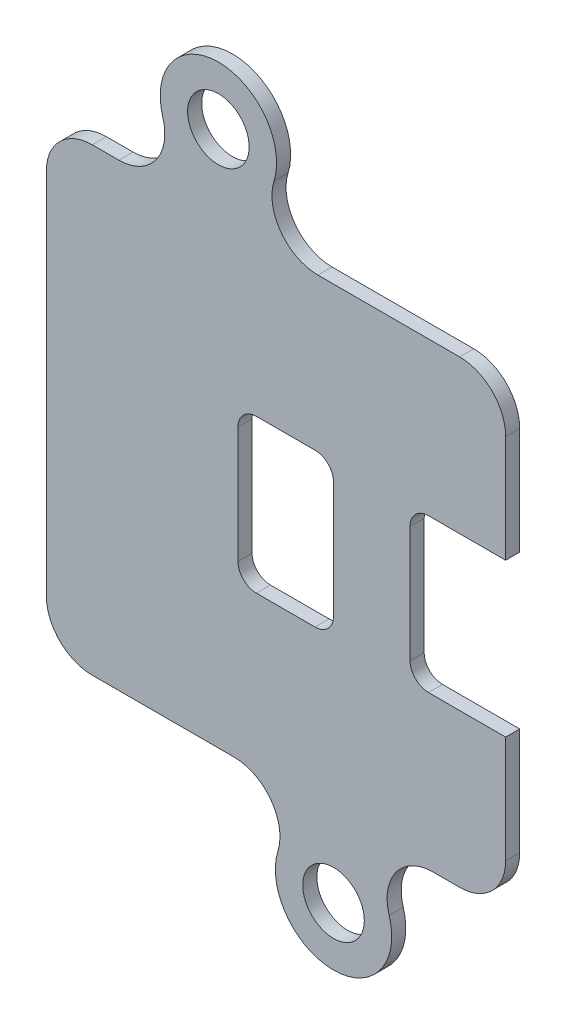
ISO-10303-21;
HEADER;
FILE_DESCRIPTION(('STEP AP214'),'2;1');
FILE_NAME('part.step','',(''),(''),'','','');
FILE_SCHEMA(('AUTOMOTIVE_DESIGN { 1 0 10303 214 1 1 1 1 }'));
ENDSEC;
DATA;
#1=APPLICATION_CONTEXT('core data for automotive mechanical design processes');
#2=APPLICATION_PROTOCOL_DEFINITION('international standard','automotive_design',2000,#1);
#3=PRODUCT_CONTEXT('',#1,'mechanical');
#4=PRODUCT('Part','Part','',(#3));
#5=PRODUCT_RELATED_PRODUCT_CATEGORY('part','',(#4));
#6=PRODUCT_DEFINITION_FORMATION('','',#4);
#7=PRODUCT_DEFINITION_CONTEXT('part definition',#1,'design');
#8=PRODUCT_DEFINITION('design','',#6,#7);
#9=PRODUCT_DEFINITION_SHAPE('','',#8);
#10=(LENGTH_UNIT() NAMED_UNIT(*) SI_UNIT(.MILLI.,.METRE.));
#11=(NAMED_UNIT(*) PLANE_ANGLE_UNIT() SI_UNIT($,.RADIAN.));
#12=(NAMED_UNIT(*) SI_UNIT($,.STERADIAN.) SOLID_ANGLE_UNIT());
#13=UNCERTAINTY_MEASURE_WITH_UNIT(LENGTH_MEASURE(1.E-05),#10,'distance_accuracy_value','');
#14=(GEOMETRIC_REPRESENTATION_CONTEXT(3) GLOBAL_UNCERTAINTY_ASSIGNED_CONTEXT((#13)) GLOBAL_UNIT_ASSIGNED_CONTEXT((#10,
#11,#12)) REPRESENTATION_CONTEXT('',''));
#15=CARTESIAN_POINT('',(0.,0.,0.));
#16=DIRECTION('',(0.,0.,1.));
#17=DIRECTION('',(1.,0.,0.));
#18=AXIS2_PLACEMENT_3D('',#15,#16,#17);
#19=CARTESIAN_POINT('',(0.,0.,0.5842));
#20=DIRECTION('',(0.,0.,-1.));
#21=DIRECTION('',(-1.,0.,0.));
#22=AXIS2_PLACEMENT_3D('',#19,#20,#21);
#23=CYLINDRICAL_SURFACE('',#22,4.826);
#24=CARTESIAN_POINT('',(0.,0.,-0.5842));
#25=DIRECTION('',(0.,0.,1.));
#26=DIRECTION('',(1.,0.,0.));
#27=AXIS2_PLACEMENT_3D('',#24,#25,#26);
#28=CIRCLE('',#27,4.826);
#29=CARTESIAN_POINT('',(-4.61254227538508,1.41941176470588,-0.5842));
#30=VERTEX_POINT('',#29);
#31=CARTESIAN_POINT('',(4.61254227538508,1.41941176470588,-0.5842));
#32=VERTEX_POINT('',#31);
#33=EDGE_CURVE('E258',#30,#32,#28,.T.);
#34=ORIENTED_EDGE('',*,*,#33,.T.);
#35=DIRECTION('',(0.,0.,-1.));
#36=VECTOR('',#35,1.);
#37=CARTESIAN_POINT('',(4.61254227538508,1.41941176470588,0.5842));
#38=LINE('',#37,#36);
#39=CARTESIAN_POINT('',(4.61254227538508,1.41941176470588,0.5842));
#40=VERTEX_POINT('',#39);
#41=EDGE_CURVE('E238',#40,#32,#38,.T.);
#42=ORIENTED_EDGE('',*,*,#41,.F.);
#43=CARTESIAN_POINT('',(0.,0.,0.5842));
#44=DIRECTION('',(0.,0.,1.));
#45=DIRECTION('',(1.,0.,0.));
#46=AXIS2_PLACEMENT_3D('',#43,#44,#45);
#47=CIRCLE('',#46,4.826);
#48=CARTESIAN_POINT('',(-4.61254227538508,1.41941176470588,0.5842));
#49=VERTEX_POINT('',#48);
#50=EDGE_CURVE('E246',#49,#40,#47,.T.);
#51=ORIENTED_EDGE('',*,*,#50,.F.);
#52=DIRECTION('',(0.,0.,-1.));
#53=VECTOR('',#52,1.);
#54=CARTESIAN_POINT('',(-4.61254227538508,1.41941176470588,0.5842));
#55=LINE('',#54,#53);
#56=EDGE_CURVE('E424',#49,#30,#55,.T.);
#57=ORIENTED_EDGE('',*,*,#56,.T.);
#58=EDGE_LOOP('',(#34,#42,#51,#57));
#59=FACE_BOUND('',#58,.T.);
#60=ADVANCED_FACE('F36',(#59),#23,.T.);
#61=CARTESIAN_POINT('',(8.25402301911013,2.54,0.5842));
#62=DIRECTION('',(0.,0.,-1.));
#63=DIRECTION('',(-1.,0.,0.));
#64=AXIS2_PLACEMENT_3D('',#61,#62,#63);
#65=CYLINDRICAL_SURFACE('',#64,3.81);
#66=CARTESIAN_POINT('',(8.25402301911013,2.54,-0.5842));
#67=DIRECTION('',(0.,0.,1.));
#68=DIRECTION('',(1.,0.,0.));
#69=AXIS2_PLACEMENT_3D('',#66,#67,#68);
#70=CIRCLE('',#69,3.81);
#71=CARTESIAN_POINT('',(8.25402301911013,6.35,-0.5842));
#72=VERTEX_POINT('',#71);
#73=EDGE_CURVE('E436',#32,#72,#70,.F.);
#74=ORIENTED_EDGE('',*,*,#73,.T.);
#75=DIRECTION('',(0.,0.,-1.));
#76=VECTOR('',#75,1.);
#77=CARTESIAN_POINT('',(8.25402301911013,6.35,0.5842));
#78=LINE('',#77,#76);
#79=CARTESIAN_POINT('',(8.25402301911013,6.35,0.5842));
#80=VERTEX_POINT('',#79);
#81=EDGE_CURVE('E241',#80,#72,#78,.T.);
#82=ORIENTED_EDGE('',*,*,#81,.F.);
#83=CARTESIAN_POINT('',(8.25402301911013,2.54,0.5842));
#84=DIRECTION('',(0.,0.,1.));
#85=DIRECTION('',(1.,0.,0.));
#86=AXIS2_PLACEMENT_3D('',#83,#84,#85);
#87=CIRCLE('',#86,3.81);
#88=EDGE_CURVE('E234',#40,#80,#87,.F.);
#89=ORIENTED_EDGE('',*,*,#88,.F.);
#90=ORIENTED_EDGE('',*,*,#41,.T.);
#91=EDGE_LOOP('',(#74,#82,#89,#90));
#92=FACE_BOUND('',#91,.T.);
#93=ADVANCED_FACE('F236',(#92),#65,.F.);
#94=CARTESIAN_POINT('',(0.,6.35,0.5842));
#95=DIRECTION('',(0.,1.,0.));
#96=DIRECTION('',(-1.,0.,0.));
#97=AXIS2_PLACEMENT_3D('',#94,#95,#96);
#98=PLANE('',#97);
#99=DIRECTION('',(1.,0.,0.));
#100=VECTOR('',#99,1.);
#101=CARTESIAN_POINT('',(0.,6.35,-0.5842));
#102=LINE('',#101,#100);
#103=CARTESIAN_POINT('',(10.4648,6.35,-0.5842));
#104=VERTEX_POINT('',#103);
#105=EDGE_CURVE('E438',#72,#104,#102,.T.);
#106=ORIENTED_EDGE('',*,*,#105,.T.);
#107=DIRECTION('',(0.,0.,-1.));
#108=VECTOR('',#107,1.);
#109=CARTESIAN_POINT('',(10.4648,6.35,0.5842));
#110=LINE('',#109,#108);
#111=CARTESIAN_POINT('',(10.4648,6.35,0.5842));
#112=VERTEX_POINT('',#111);
#113=EDGE_CURVE('E288',#104,#112,#110,.F.);
#114=ORIENTED_EDGE('',*,*,#113,.T.);
#115=DIRECTION('',(1.,0.,0.));
#116=VECTOR('',#115,1.);
#117=CARTESIAN_POINT('',(0.,6.35,0.5842));
#118=LINE('',#117,#116);
#119=EDGE_CURVE('E245',#80,#112,#118,.T.);
#120=ORIENTED_EDGE('',*,*,#119,.F.);
#121=ORIENTED_EDGE('',*,*,#81,.T.);
#122=EDGE_LOOP('',(#106,#114,#120,#121));
#123=FACE_BOUND('',#122,.T.);
#124=ADVANCED_FACE('F505',(#123),#98,.F.);
#125=CARTESIAN_POINT('',(14.2748,0.,0.5842));
#126=DIRECTION('',(1.,0.,0.));
#127=DIRECTION('',(0.,1.,0.));
#128=AXIS2_PLACEMENT_3D('',#125,#126,#127);
#129=PLANE('',#128);
#130=DIRECTION('',(0.,-1.,0.));
#131=VECTOR('',#130,1.);
#132=CARTESIAN_POINT('',(14.2748,0.,0.5842));
#133=LINE('',#132,#131);
#134=CARTESIAN_POINT('',(14.2748,19.05,0.5842));
#135=VERTEX_POINT('',#134);
#136=CARTESIAN_POINT('',(14.2748,10.16,0.5842));
#137=VERTEX_POINT('',#136);
#138=EDGE_CURVE('E391',#135,#137,#133,.T.);
#139=ORIENTED_EDGE('',*,*,#138,.T.);
#140=DIRECTION('',(0.,0.,-1.));
#141=VECTOR('',#140,1.);
#142=CARTESIAN_POINT('',(14.2748,10.16,-0.5842));
#143=LINE('',#142,#141);
#144=CARTESIAN_POINT('',(14.2748,10.16,-0.5842));
#145=VERTEX_POINT('',#144);
#146=EDGE_CURVE('E285',#137,#145,#143,.T.);
#147=ORIENTED_EDGE('',*,*,#146,.T.);
#148=DIRECTION('',(0.,-1.,0.));
#149=VECTOR('',#148,1.);
#150=CARTESIAN_POINT('',(14.2748,0.,-0.5842));
#151=LINE('',#150,#149);
#152=CARTESIAN_POINT('',(14.2748,19.05,-0.5842));
#153=VERTEX_POINT('',#152);
#154=EDGE_CURVE('E441',#153,#145,#151,.T.);
#155=ORIENTED_EDGE('',*,*,#154,.F.);
#156=DIRECTION('',(0.,0.,-1.));
#157=VECTOR('',#156,1.);
#158=CARTESIAN_POINT('',(14.2748,19.05,0.5842));
#159=LINE('',#158,#157);
#160=EDGE_CURVE('E264',#135,#153,#159,.T.);
#161=ORIENTED_EDGE('',*,*,#160,.F.);
#162=EDGE_LOOP('',(#139,#147,#155,#161));
#163=FACE_BOUND('',#162,.T.);
#164=ADVANCED_FACE('F497',(#163),#129,.T.);
#165=CARTESIAN_POINT('',(0.,19.05,0.5842));
#166=DIRECTION('',(0.,-1.,0.));
#167=DIRECTION('',(0.,0.,-1.));
#168=AXIS2_PLACEMENT_3D('',#165,#166,#167);
#169=PLANE('',#168);
#170=DIRECTION('',(-1.,0.,0.));
#171=VECTOR('',#170,1.);
#172=CARTESIAN_POINT('',(0.,19.05,-0.5842));
#173=LINE('',#172,#171);
#174=CARTESIAN_POINT('',(7.874,19.05,-0.5842));
#175=VERTEX_POINT('',#174);
#176=EDGE_CURVE('E444',#153,#175,#173,.T.);
#177=ORIENTED_EDGE('',*,*,#176,.T.);
#178=DIRECTION('',(0.,0.,-1.));
#179=VECTOR('',#178,1.);
#180=CARTESIAN_POINT('',(7.874,19.05,0.5842));
#181=LINE('',#180,#179);
#182=CARTESIAN_POINT('',(7.874,19.05,0.5842));
#183=VERTEX_POINT('',#182);
#184=EDGE_CURVE('E305',#175,#183,#181,.F.);
#185=ORIENTED_EDGE('',*,*,#184,.T.);
#186=DIRECTION('',(-1.,0.,0.));
#187=VECTOR('',#186,1.);
#188=CARTESIAN_POINT('',(0.,19.05,0.5842));
#189=LINE('',#188,#187);
#190=EDGE_CURVE('E394',#135,#183,#189,.T.);
#191=ORIENTED_EDGE('',*,*,#190,.F.);
#192=ORIENTED_EDGE('',*,*,#160,.T.);
#193=EDGE_LOOP('',(#177,#185,#191,#192));
#194=FACE_BOUND('',#193,.T.);
#195=ADVANCED_FACE('F491',(#194),#169,.F.);
#196=CARTESIAN_POINT('',(6.35,0.,0.5842));
#197=DIRECTION('',(1.,0.,0.));
#198=DIRECTION('',(0.,1.,0.));
#199=AXIS2_PLACEMENT_3D('',#196,#197,#198);
#200=PLANE('',#199);
#201=DIRECTION('',(0.,-1.,0.));
#202=VECTOR('',#201,1.);
#203=CARTESIAN_POINT('',(6.35,0.,0.5842));
#204=LINE('',#203,#202);
#205=CARTESIAN_POINT('',(6.35,30.226,0.5842));
#206=VERTEX_POINT('',#205);
#207=CARTESIAN_POINT('',(6.35,20.574,0.5842));
#208=VERTEX_POINT('',#207);
#209=EDGE_CURVE('E397',#206,#208,#204,.T.);
#210=ORIENTED_EDGE('',*,*,#209,.T.);
#211=DIRECTION('',(0.,0.,-1.));
#212=VECTOR('',#211,1.);
#213=CARTESIAN_POINT('',(6.35,20.574,0.5842));
#214=LINE('',#213,#212);
#215=CARTESIAN_POINT('',(6.35,20.574,-0.5842));
#216=VERTEX_POINT('',#215);
#217=EDGE_CURVE('E302',#208,#216,#214,.T.);
#218=ORIENTED_EDGE('',*,*,#217,.T.);
#219=DIRECTION('',(0.,-1.,0.));
#220=VECTOR('',#219,1.);
#221=CARTESIAN_POINT('',(6.35,0.,-0.5842));
#222=LINE('',#221,#220);
#223=CARTESIAN_POINT('',(6.35,30.226,-0.5842));
#224=VERTEX_POINT('',#223);
#225=EDGE_CURVE('E447',#224,#216,#222,.T.);
#226=ORIENTED_EDGE('',*,*,#225,.F.);
#227=DIRECTION('',(0.,0.,-1.));
#228=VECTOR('',#227,1.);
#229=CARTESIAN_POINT('',(6.35,30.226,0.5842));
#230=LINE('',#229,#228);
#231=EDGE_CURVE('E300',#224,#206,#230,.F.);
#232=ORIENTED_EDGE('',*,*,#231,.T.);
#233=EDGE_LOOP('',(#210,#218,#226,#232));
#234=FACE_BOUND('',#233,.T.);
#235=ADVANCED_FACE('F513',(#234),#200,.T.);
#236=CARTESIAN_POINT('',(0.,31.75,0.5842));
#237=DIRECTION('',(0.,-1.,0.));
#238=DIRECTION('',(1.,0.,0.));
#239=AXIS2_PLACEMENT_3D('',#236,#237,#238);
#240=PLANE('',#239);
#241=DIRECTION('',(-1.,0.,0.));
#242=VECTOR('',#241,1.);
#243=CARTESIAN_POINT('',(0.,31.75,0.5842));
#244=LINE('',#243,#242);
#245=CARTESIAN_POINT('',(14.2748,31.75,0.5842));
#246=VERTEX_POINT('',#245);
#247=CARTESIAN_POINT('',(7.874,31.75,0.5842));
#248=VERTEX_POINT('',#247);
#249=EDGE_CURVE('E400',#246,#248,#244,.T.);
#250=ORIENTED_EDGE('',*,*,#249,.T.);
#251=DIRECTION('',(0.,0.,-1.));
#252=VECTOR('',#251,1.);
#253=CARTESIAN_POINT('',(7.874,31.75,-0.5842));
#254=LINE('',#253,#252);
#255=CARTESIAN_POINT('',(7.874,31.75,-0.5842));
#256=VERTEX_POINT('',#255);
#257=EDGE_CURVE('E307',#248,#256,#254,.T.);
#258=ORIENTED_EDGE('',*,*,#257,.T.);
#259=DIRECTION('',(-1.,0.,0.));
#260=VECTOR('',#259,1.);
#261=CARTESIAN_POINT('',(0.,31.75,-0.5842));
#262=LINE('',#261,#260);
#263=CARTESIAN_POINT('',(14.2748,31.75,-0.5842));
#264=VERTEX_POINT('',#263);
#265=EDGE_CURVE('E450',#264,#256,#262,.T.);
#266=ORIENTED_EDGE('',*,*,#265,.F.);
#267=DIRECTION('',(0.,0.,-1.));
#268=VECTOR('',#267,1.);
#269=CARTESIAN_POINT('',(14.2748,31.75,0.5842));
#270=LINE('',#269,#268);
#271=EDGE_CURVE('E486',#246,#264,#270,.T.);
#272=ORIENTED_EDGE('',*,*,#271,.F.);
#273=EDGE_LOOP('',(#250,#258,#266,#272));
#274=FACE_BOUND('',#273,.T.);
#275=ADVANCED_FACE('F521',(#274),#240,.T.);
#276=CARTESIAN_POINT('',(14.2748,0.,0.5842));
#277=DIRECTION('',(1.,0.,0.));
#278=DIRECTION('',(0.,1.,0.));
#279=AXIS2_PLACEMENT_3D('',#276,#277,#278);
#280=PLANE('',#279);
#281=DIRECTION('',(0.,-1.,0.));
#282=VECTOR('',#281,1.);
#283=CARTESIAN_POINT('',(14.2748,0.,-0.5842));
#284=LINE('',#283,#282);
#285=CARTESIAN_POINT('',(14.2748,40.64,-0.5842));
#286=VERTEX_POINT('',#285);
#287=EDGE_CURVE('E453',#286,#264,#284,.T.);
#288=ORIENTED_EDGE('',*,*,#287,.F.);
#289=DIRECTION('',(0.,0.,-1.));
#290=VECTOR('',#289,1.);
#291=CARTESIAN_POINT('',(14.2748,40.64,0.5842));
#292=LINE('',#291,#290);
#293=CARTESIAN_POINT('',(14.2748,40.64,0.5842));
#294=VERTEX_POINT('',#293);
#295=EDGE_CURVE('E275',#286,#294,#292,.F.);
#296=ORIENTED_EDGE('',*,*,#295,.T.);
#297=DIRECTION('',(0.,-1.,0.));
#298=VECTOR('',#297,1.);
#299=CARTESIAN_POINT('',(14.2748,0.,0.5842));
#300=LINE('',#299,#298);
#301=EDGE_CURVE('E403',#294,#246,#300,.T.);
#302=ORIENTED_EDGE('',*,*,#301,.T.);
#303=ORIENTED_EDGE('',*,*,#271,.T.);
#304=EDGE_LOOP('',(#288,#296,#302,#303));
#305=FACE_BOUND('',#304,.T.);
#306=ADVANCED_FACE('F728',(#305),#280,.T.);
#307=CARTESIAN_POINT('',(0.,44.45,0.5842));
#308=DIRECTION('',(0.,1.,0.));
#309=DIRECTION('',(0.,0.,1.));
#310=AXIS2_PLACEMENT_3D('',#307,#308,#309);
#311=PLANE('',#310);
#312=DIRECTION('',(1.,0.,0.));
#313=VECTOR('',#312,1.);
#314=CARTESIAN_POINT('',(0.,44.45,0.5842));
#315=LINE('',#314,#313);
#316=CARTESIAN_POINT('',(-1.29637698088987,44.45,0.5842));
#317=VERTEX_POINT('',#316);
#318=CARTESIAN_POINT('',(10.4648,44.45,0.5842));
#319=VERTEX_POINT('',#318);
#320=EDGE_CURVE('E405',#317,#319,#315,.T.);
#321=ORIENTED_EDGE('',*,*,#320,.T.);
#322=DIRECTION('',(0.,0.,-1.));
#323=VECTOR('',#322,1.);
#324=CARTESIAN_POINT('',(10.4648,44.45,0.5842));
#325=LINE('',#324,#323);
#326=CARTESIAN_POINT('',(10.4648,44.45,-0.5842));
#327=VERTEX_POINT('',#326);
#328=EDGE_CURVE('E259',#319,#327,#325,.T.);
#329=ORIENTED_EDGE('',*,*,#328,.T.);
#330=DIRECTION('',(1.,0.,0.));
#331=VECTOR('',#330,1.);
#332=CARTESIAN_POINT('',(0.,44.45,-0.5842));
#333=LINE('',#332,#331);
#334=CARTESIAN_POINT('',(-1.29637698088987,44.45,-0.5842));
#335=VERTEX_POINT('',#334);
#336=EDGE_CURVE('E455',#335,#327,#333,.T.);
#337=ORIENTED_EDGE('',*,*,#336,.F.);
#338=DIRECTION('',(0.,0.,-1.));
#339=VECTOR('',#338,1.);
#340=CARTESIAN_POINT('',(-1.29637698088987,44.45,0.5842));
#341=LINE('',#340,#339);
#342=EDGE_CURVE('E484',#317,#335,#341,.T.);
#343=ORIENTED_EDGE('',*,*,#342,.F.);
#344=EDGE_LOOP('',(#321,#329,#337,#343));
#345=FACE_BOUND('',#344,.T.);
#346=ADVANCED_FACE('F533',(#345),#311,.T.);
#347=CARTESIAN_POINT('',(-1.29637698088987,48.26,0.5842));
#348=DIRECTION('',(0.,0.,-1.));
#349=DIRECTION('',(-1.,0.,0.));
#350=AXIS2_PLACEMENT_3D('',#347,#348,#349);
#351=CYLINDRICAL_SURFACE('',#350,3.81);
#352=CARTESIAN_POINT('',(-1.29637698088987,48.26,-0.5842));
#353=DIRECTION('',(0.,0.,1.));
#354=DIRECTION('',(1.,0.,0.));
#355=AXIS2_PLACEMENT_3D('',#352,#353,#354);
#356=CIRCLE('',#355,3.81);
#357=CARTESIAN_POINT('',(-4.93785772461493,49.3805882352941,-0.5842));
#358=VERTEX_POINT('',#357);
#359=EDGE_CURVE('E458',#358,#335,#356,.T.);
#360=ORIENTED_EDGE('',*,*,#359,.F.);
#361=DIRECTION('',(0.,0.,-1.));
#362=VECTOR('',#361,1.);
#363=CARTESIAN_POINT('',(-4.93785772461493,49.3805882352941,0.5842));
#364=LINE('',#363,#362);
#365=CARTESIAN_POINT('',(-4.93785772461493,49.3805882352941,0.5842));
#366=VERTEX_POINT('',#365);
#367=EDGE_CURVE('E482',#366,#358,#364,.T.);
#368=ORIENTED_EDGE('',*,*,#367,.F.);
#369=CARTESIAN_POINT('',(-1.29637698088987,48.26,0.5842));
#370=DIRECTION('',(0.,0.,1.));
#371=DIRECTION('',(1.,0.,0.));
#372=AXIS2_PLACEMENT_3D('',#369,#370,#371);
#373=CIRCLE('',#372,3.81);
#374=EDGE_CURVE('E408',#366,#317,#373,.T.);
#375=ORIENTED_EDGE('',*,*,#374,.T.);
#376=ORIENTED_EDGE('',*,*,#342,.T.);
#377=EDGE_LOOP('',(#360,#368,#375,#376));
#378=FACE_BOUND('',#377,.T.);
#379=ADVANCED_FACE('F539',(#378),#351,.F.);
#380=CARTESIAN_POINT('',(-9.55040000000001,50.8,0.5842));
#381=DIRECTION('',(0.,0.,-1.));
#382=DIRECTION('',(-1.,0.,0.));
#383=AXIS2_PLACEMENT_3D('',#380,#381,#382);
#384=CYLINDRICAL_SURFACE('',#383,4.826);
#385=CARTESIAN_POINT('',(-9.55040000000001,50.8,-0.5842));
#386=DIRECTION('',(0.,0.,1.));
#387=DIRECTION('',(1.,0.,0.));
#388=AXIS2_PLACEMENT_3D('',#385,#386,#387);
#389=CIRCLE('',#388,4.826);
#390=CARTESIAN_POINT('',(-14.1629422753851,49.3805882352941,-0.5842));
#391=VERTEX_POINT('',#390);
#392=EDGE_CURVE('E461',#358,#391,#389,.T.);
#393=ORIENTED_EDGE('',*,*,#392,.T.);
#394=DIRECTION('',(0.,0.,-1.));
#395=VECTOR('',#394,1.);
#396=CARTESIAN_POINT('',(-14.1629422753851,49.3805882352941,0.5842));
#397=LINE('',#396,#395);
#398=CARTESIAN_POINT('',(-14.1629422753851,49.3805882352941,0.5842));
#399=VERTEX_POINT('',#398);
#400=EDGE_CURVE('E479',#399,#391,#397,.T.);
#401=ORIENTED_EDGE('',*,*,#400,.F.);
#402=CARTESIAN_POINT('',(-9.55040000000001,50.8,0.5842));
#403=DIRECTION('',(0.,0.,1.));
#404=DIRECTION('',(1.,0.,0.));
#405=AXIS2_PLACEMENT_3D('',#402,#403,#404);
#406=CIRCLE('',#405,4.826);
#407=EDGE_CURVE('E411',#366,#399,#406,.T.);
#408=ORIENTED_EDGE('',*,*,#407,.F.);
#409=ORIENTED_EDGE('',*,*,#367,.T.);
#410=EDGE_LOOP('',(#393,#401,#408,#409));
#411=FACE_BOUND('',#410,.T.);
#412=ADVANCED_FACE('F547',(#411),#384,.T.);
#413=CARTESIAN_POINT('',(-17.8044230191101,48.26,0.5842));
#414=DIRECTION('',(0.,0.,-1.));
#415=DIRECTION('',(-1.,0.,0.));
#416=AXIS2_PLACEMENT_3D('',#413,#414,#415);
#417=CYLINDRICAL_SURFACE('',#416,3.81);
#418=CARTESIAN_POINT('',(-17.8044230191101,48.26,-0.5842));
#419=DIRECTION('',(0.,0.,1.));
#420=DIRECTION('',(1.,0.,0.));
#421=AXIS2_PLACEMENT_3D('',#418,#419,#420);
#422=CIRCLE('',#421,3.81);
#423=CARTESIAN_POINT('',(-17.8044230191101,44.45,-0.5842));
#424=VERTEX_POINT('',#423);
#425=EDGE_CURVE('E463',#391,#424,#422,.F.);
#426=ORIENTED_EDGE('',*,*,#425,.T.);
#427=DIRECTION('',(0.,0.,-1.));
#428=VECTOR('',#427,1.);
#429=CARTESIAN_POINT('',(-17.8044230191101,44.45,0.5842));
#430=LINE('',#429,#428);
#431=CARTESIAN_POINT('',(-17.8044230191101,44.45,0.5842));
#432=VERTEX_POINT('',#431);
#433=EDGE_CURVE('E476',#432,#424,#430,.T.);
#434=ORIENTED_EDGE('',*,*,#433,.F.);
#435=CARTESIAN_POINT('',(-17.8044230191101,48.26,0.5842));
#436=DIRECTION('',(0.,0.,1.));
#437=DIRECTION('',(1.,0.,0.));
#438=AXIS2_PLACEMENT_3D('',#435,#436,#437);
#439=CIRCLE('',#438,3.81);
#440=EDGE_CURVE('E413',#399,#432,#439,.F.);
#441=ORIENTED_EDGE('',*,*,#440,.F.);
#442=ORIENTED_EDGE('',*,*,#400,.T.);
#443=EDGE_LOOP('',(#426,#434,#441,#442));
#444=FACE_BOUND('',#443,.T.);
#445=ADVANCED_FACE('F549',(#444),#417,.F.);
#446=CARTESIAN_POINT('',(0.,44.45,0.5842));
#447=DIRECTION('',(0.,1.,0.));
#448=DIRECTION('',(-1.,0.,0.));
#449=AXIS2_PLACEMENT_3D('',#446,#447,#448);
#450=PLANE('',#449);
#451=DIRECTION('',(1.,0.,0.));
#452=VECTOR('',#451,1.);
#453=CARTESIAN_POINT('',(0.,44.45,-0.5842));
#454=LINE('',#453,#452);
#455=CARTESIAN_POINT('',(-20.0152,44.45,-0.5842));
#456=VERTEX_POINT('',#455);
#457=EDGE_CURVE('E466',#456,#424,#454,.T.);
#458=ORIENTED_EDGE('',*,*,#457,.F.);
#459=DIRECTION('',(0.,0.,-1.));
#460=VECTOR('',#459,1.);
#461=CARTESIAN_POINT('',(-20.0152,44.45,0.5842));
#462=LINE('',#461,#460);
#463=CARTESIAN_POINT('',(-20.0152,44.45,0.5842));
#464=VERTEX_POINT('',#463);
#465=EDGE_CURVE('E298',#456,#464,#462,.F.);
#466=ORIENTED_EDGE('',*,*,#465,.T.);
#467=DIRECTION('',(1.,0.,0.));
#468=VECTOR('',#467,1.);
#469=CARTESIAN_POINT('',(0.,44.45,0.5842));
#470=LINE('',#469,#468);
#471=EDGE_CURVE('E416',#464,#432,#470,.T.);
#472=ORIENTED_EDGE('',*,*,#471,.T.);
#473=ORIENTED_EDGE('',*,*,#433,.T.);
#474=EDGE_LOOP('',(#458,#466,#472,#473));
#475=FACE_BOUND('',#474,.T.);
#476=ADVANCED_FACE('F552',(#475),#450,.T.);
#477=CARTESIAN_POINT('',(-23.8252,0.,0.5842));
#478=DIRECTION('',(1.,0.,0.));
#479=DIRECTION('',(0.,0.,-1.));
#480=AXIS2_PLACEMENT_3D('',#477,#478,#479);
#481=PLANE('',#480);
#482=DIRECTION('',(0.,-1.,0.));
#483=VECTOR('',#482,1.);
#484=CARTESIAN_POINT('',(-23.8252,0.,-0.5842));
#485=LINE('',#484,#483);
#486=CARTESIAN_POINT('',(-23.8252,40.64,-0.5842));
#487=VERTEX_POINT('',#486);
#488=CARTESIAN_POINT('',(-23.8252,10.16,-0.5842));
#489=VERTEX_POINT('',#488);
#490=EDGE_CURVE('E468',#487,#489,#485,.T.);
#491=ORIENTED_EDGE('',*,*,#490,.T.);
#492=DIRECTION('',(0.,0.,-1.));
#493=VECTOR('',#492,1.);
#494=CARTESIAN_POINT('',(-23.8252,10.16,0.5842));
#495=LINE('',#494,#493);
#496=CARTESIAN_POINT('',(-23.8252,10.16,0.5842));
#497=VERTEX_POINT('',#496);
#498=EDGE_CURVE('E296',#489,#497,#495,.F.);
#499=ORIENTED_EDGE('',*,*,#498,.T.);
#500=DIRECTION('',(0.,-1.,0.));
#501=VECTOR('',#500,1.);
#502=CARTESIAN_POINT('',(-23.8252,0.,0.5842));
#503=LINE('',#502,#501);
#504=CARTESIAN_POINT('',(-23.8252,40.64,0.5842));
#505=VERTEX_POINT('',#504);
#506=EDGE_CURVE('E418',#505,#497,#503,.T.);
#507=ORIENTED_EDGE('',*,*,#506,.F.);
#508=DIRECTION('',(0.,0.,-1.));
#509=VECTOR('',#508,1.);
#510=CARTESIAN_POINT('',(-23.8252,40.64,-0.5842));
#511=LINE('',#510,#509);
#512=EDGE_CURVE('E293',#505,#487,#511,.T.);
#513=ORIENTED_EDGE('',*,*,#512,.T.);
#514=EDGE_LOOP('',(#491,#499,#507,#513));
#515=FACE_BOUND('',#514,.T.);
#516=ADVANCED_FACE('F561',(#515),#481,.F.);
#517=CARTESIAN_POINT('',(0.,6.35,0.5842));
#518=DIRECTION('',(0.,1.,0.));
#519=DIRECTION('',(-1.,0.,0.));
#520=AXIS2_PLACEMENT_3D('',#517,#518,#519);
#521=PLANE('',#520);
#522=DIRECTION('',(1.,0.,0.));
#523=VECTOR('',#522,1.);
#524=CARTESIAN_POINT('',(0.,6.35,0.5842));
#525=LINE('',#524,#523);
#526=CARTESIAN_POINT('',(-20.0152,6.35,0.5842));
#527=VERTEX_POINT('',#526);
#528=CARTESIAN_POINT('',(-8.25402301911013,6.35,0.5842));
#529=VERTEX_POINT('',#528);
#530=EDGE_CURVE('E421',#527,#529,#525,.T.);
#531=ORIENTED_EDGE('',*,*,#530,.F.);
#532=DIRECTION('',(0.,0.,-1.));
#533=VECTOR('',#532,1.);
#534=CARTESIAN_POINT('',(-20.0152,6.35,0.5842));
#535=LINE('',#534,#533);
#536=CARTESIAN_POINT('',(-20.0152,6.35,-0.5842));
#537=VERTEX_POINT('',#536);
#538=EDGE_CURVE('E290',#527,#537,#535,.T.);
#539=ORIENTED_EDGE('',*,*,#538,.T.);
#540=DIRECTION('',(1.,0.,0.));
#541=VECTOR('',#540,1.);
#542=CARTESIAN_POINT('',(0.,6.35,-0.5842));
#543=LINE('',#542,#541);
#544=CARTESIAN_POINT('',(-8.25402301911013,6.35,-0.5842));
#545=VERTEX_POINT('',#544);
#546=EDGE_CURVE('E380',#537,#545,#543,.T.);
#547=ORIENTED_EDGE('',*,*,#546,.T.);
#548=DIRECTION('',(0.,0.,-1.));
#549=VECTOR('',#548,1.);
#550=CARTESIAN_POINT('',(-8.25402301911013,6.35,0.5842));
#551=LINE('',#550,#549);
#552=EDGE_CURVE('E473',#529,#545,#551,.T.);
#553=ORIENTED_EDGE('',*,*,#552,.F.);
#554=EDGE_LOOP('',(#531,#539,#547,#553));
#555=FACE_BOUND('',#554,.T.);
#556=ADVANCED_FACE('F570',(#555),#521,.F.);
#557=CARTESIAN_POINT('',(-7.9248,0.,0.5842));
#558=DIRECTION('',(1.,0.,0.));
#559=DIRECTION('',(0.,1.,0.));
#560=AXIS2_PLACEMENT_3D('',#557,#558,#559);
#561=PLANE('',#560);
#562=DIRECTION('',(0.,-1.,0.));
#563=VECTOR('',#562,1.);
#564=CARTESIAN_POINT('',(-7.9248,0.,-0.5842));
#565=LINE('',#564,#563);
#566=CARTESIAN_POINT('',(-7.9248,30.226,-0.5842));
#567=VERTEX_POINT('',#566);
#568=CARTESIAN_POINT('',(-7.9248,20.574,-0.5842));
#569=VERTEX_POINT('',#568);
#570=EDGE_CURVE('E355',#567,#569,#565,.T.);
#571=ORIENTED_EDGE('',*,*,#570,.F.);
#572=DIRECTION('',(0.,0.,-1.));
#573=VECTOR('',#572,1.);
#574=CARTESIAN_POINT('',(-7.9248,30.226,0.5842));
#575=LINE('',#574,#573);
#576=CARTESIAN_POINT('',(-7.9248,30.226,0.5842));
#577=VERTEX_POINT('',#576);
#578=EDGE_CURVE('E318',#567,#577,#575,.F.);
#579=ORIENTED_EDGE('',*,*,#578,.T.);
#580=DIRECTION('',(0.,-1.,0.));
#581=VECTOR('',#580,1.);
#582=CARTESIAN_POINT('',(-7.9248,0.,0.5842));
#583=LINE('',#582,#581);
#584=CARTESIAN_POINT('',(-7.9248,20.574,0.5842));
#585=VERTEX_POINT('',#584);
#586=EDGE_CURVE('E367',#577,#585,#583,.T.);
#587=ORIENTED_EDGE('',*,*,#586,.T.);
#588=DIRECTION('',(0.,0.,-1.));
#589=VECTOR('',#588,1.);
#590=CARTESIAN_POINT('',(-7.9248,20.574,0.5842));
#591=LINE('',#590,#589);
#592=EDGE_CURVE('E315',#585,#569,#591,.T.);
#593=ORIENTED_EDGE('',*,*,#592,.T.);
#594=EDGE_LOOP('',(#571,#579,#587,#593));
#595=FACE_BOUND('',#594,.T.);
#596=ADVANCED_FACE('F371',(#595),#561,.T.);
#597=CARTESIAN_POINT('',(0.,31.75,0.5842));
#598=DIRECTION('',(0.,-1.,0.));
#599=DIRECTION('',(0.,0.,-1.));
#600=AXIS2_PLACEMENT_3D('',#597,#598,#599);
#601=PLANE('',#600);
#602=DIRECTION('',(-1.,0.,0.));
#603=VECTOR('',#602,1.);
#604=CARTESIAN_POINT('',(0.,31.75,0.5842));
#605=LINE('',#604,#603);
#606=CARTESIAN_POINT('',(-1.524,31.75,0.5842));
#607=VERTEX_POINT('',#606);
#608=CARTESIAN_POINT('',(-6.4008,31.75,0.5842));
#609=VERTEX_POINT('',#608);
#610=EDGE_CURVE('E373',#607,#609,#605,.T.);
#611=ORIENTED_EDGE('',*,*,#610,.T.);
#612=DIRECTION('',(0.,0.,-1.));
#613=VECTOR('',#612,1.);
#614=CARTESIAN_POINT('',(-6.4008,31.75,-0.5842));
#615=LINE('',#614,#613);
#616=CARTESIAN_POINT('',(-6.4008,31.75,-0.5842));
#617=VERTEX_POINT('',#616);
#618=EDGE_CURVE('E312',#609,#617,#615,.T.);
#619=ORIENTED_EDGE('',*,*,#618,.T.);
#620=DIRECTION('',(-1.,0.,0.));
#621=VECTOR('',#620,1.);
#622=CARTESIAN_POINT('',(0.,31.75,-0.5842));
#623=LINE('',#622,#621);
#624=CARTESIAN_POINT('',(-1.524,31.75,-0.5842));
#625=VERTEX_POINT('',#624);
#626=EDGE_CURVE('E426',#625,#617,#623,.T.);
#627=ORIENTED_EDGE('',*,*,#626,.F.);
#628=DIRECTION('',(0.,0.,-1.));
#629=VECTOR('',#628,1.);
#630=CARTESIAN_POINT('',(-1.524,31.75,0.5842));
#631=LINE('',#630,#629);
#632=EDGE_CURVE('E310',#625,#607,#631,.F.);
#633=ORIENTED_EDGE('',*,*,#632,.T.);
#634=EDGE_LOOP('',(#611,#619,#627,#633));
#635=FACE_BOUND('',#634,.T.);
#636=ADVANCED_FACE('F604',(#635),#601,.T.);
#637=CARTESIAN_POINT('',(0.,0.,0.5842));
#638=DIRECTION('',(1.,0.,0.));
#639=DIRECTION('',(0.,0.,-1.));
#640=AXIS2_PLACEMENT_3D('',#637,#638,#639);
#641=PLANE('',#640);
#642=DIRECTION('',(0.,-1.,0.));
#643=VECTOR('',#642,1.);
#644=CARTESIAN_POINT('',(0.,0.,0.5842));
#645=LINE('',#644,#643);
#646=CARTESIAN_POINT('',(0.,30.226,0.5842));
#647=VERTEX_POINT('',#646);
#648=CARTESIAN_POINT('',(0.,20.574,0.5842));
#649=VERTEX_POINT('',#648);
#650=EDGE_CURVE('E377',#647,#649,#645,.T.);
#651=ORIENTED_EDGE('',*,*,#650,.F.);
#652=DIRECTION('',(0.,0.,-1.));
#653=VECTOR('',#652,1.);
#654=CARTESIAN_POINT('',(0.,30.226,0.5842));
#655=LINE('',#654,#653);
#656=CARTESIAN_POINT('',(0.,30.226,-0.5842));
#657=VERTEX_POINT('',#656);
#658=EDGE_CURVE('E322',#647,#657,#655,.T.);
#659=ORIENTED_EDGE('',*,*,#658,.T.);
#660=DIRECTION('',(0.,-1.,0.));
#661=VECTOR('',#660,1.);
#662=CARTESIAN_POINT('',(0.,0.,-0.5842));
#663=LINE('',#662,#661);
#664=CARTESIAN_POINT('',(0.,20.574,-0.5842));
#665=VERTEX_POINT('',#664);
#666=EDGE_CURVE('E361',#657,#665,#663,.T.);
#667=ORIENTED_EDGE('',*,*,#666,.T.);
#668=DIRECTION('',(0.,0.,-1.));
#669=VECTOR('',#668,1.);
#670=CARTESIAN_POINT('',(0.,20.574,0.5842));
#671=LINE('',#670,#669);
#672=EDGE_CURVE('E320',#665,#649,#671,.F.);
#673=ORIENTED_EDGE('',*,*,#672,.T.);
#674=EDGE_LOOP('',(#651,#659,#667,#673));
#675=FACE_BOUND('',#674,.T.);
#676=ADVANCED_FACE('F597',(#675),#641,.F.);
#677=CARTESIAN_POINT('',(-9.55040000000001,50.8,0.5842));
#678=DIRECTION('',(0.,0.,-1.));
#679=DIRECTION('',(-1.,0.,0.));
#680=AXIS2_PLACEMENT_3D('',#677,#678,#679);
#681=CYLINDRICAL_SURFACE('',#680,2.5527);
#682=CARTESIAN_POINT('',(-9.55040000000001,50.8,0.5842));
#683=DIRECTION('',(0.,0.,1.));
#684=DIRECTION('',(1.,0.,0.));
#685=AXIS2_PLACEMENT_3D('',#682,#683,#684);
#686=CIRCLE('',#685,2.5527);
#687=CARTESIAN_POINT('',(-6.9977,50.8,0.5842));
#688=VERTEX_POINT('',#687);
#689=EDGE_CURVE('E255',#688,#688,#686,.T.);
#690=ORIENTED_EDGE('',*,*,#689,.T.);
#691=EDGE_LOOP('',(#690));
#692=FACE_BOUND('',#691,.T.);
#693=CARTESIAN_POINT('',(-9.55040000000001,50.8,-0.5842));
#694=DIRECTION('',(0.,0.,1.));
#695=DIRECTION('',(1.,0.,0.));
#696=AXIS2_PLACEMENT_3D('',#693,#694,#695);
#697=CIRCLE('',#696,2.5527);
#698=CARTESIAN_POINT('',(-6.9977,50.8,-0.5842));
#699=VERTEX_POINT('',#698);
#700=EDGE_CURVE('E432',#699,#699,#697,.T.);
#701=ORIENTED_EDGE('',*,*,#700,.F.);
#702=EDGE_LOOP('',(#701));
#703=FACE_BOUND('',#702,.T.);
#704=ADVANCED_FACE('F594',(#692,#703),#681,.F.);
#705=CARTESIAN_POINT('',(0.,0.,0.5842));
#706=DIRECTION('',(0.,0.,-1.));
#707=DIRECTION('',(-1.,0.,0.));
#708=AXIS2_PLACEMENT_3D('',#705,#706,#707);
#709=CYLINDRICAL_SURFACE('',#708,2.5527);
#710=CARTESIAN_POINT('',(0.,0.,0.5842));
#711=DIRECTION('',(0.,0.,1.));
#712=DIRECTION('',(1.,0.,0.));
#713=AXIS2_PLACEMENT_3D('',#710,#711,#712);
#714=CIRCLE('',#713,2.5527);
#715=CARTESIAN_POINT('',(2.5527,0.,0.5842));
#716=VERTEX_POINT('',#715);
#717=EDGE_CURVE('E385',#716,#716,#714,.T.);
#718=ORIENTED_EDGE('',*,*,#717,.T.);
#719=EDGE_LOOP('',(#718));
#720=FACE_BOUND('',#719,.T.);
#721=CARTESIAN_POINT('',(0.,0.,-0.5842));
#722=DIRECTION('',(0.,0.,1.));
#723=DIRECTION('',(1.,0.,0.));
#724=AXIS2_PLACEMENT_3D('',#721,#722,#723);
#725=CIRCLE('',#724,2.5527);
#726=CARTESIAN_POINT('',(2.5527,0.,-0.5842));
#727=VERTEX_POINT('',#726);
#728=EDGE_CURVE('E360',#727,#727,#725,.T.);
#729=ORIENTED_EDGE('',*,*,#728,.F.);
#730=EDGE_LOOP('',(#729));
#731=FACE_BOUND('',#730,.T.);
#732=ADVANCED_FACE('F582',(#720,#731),#709,.F.);
#733=CARTESIAN_POINT('',(0.,19.05,0.5842));
#734=DIRECTION('',(0.,-1.,0.));
#735=DIRECTION('',(0.,0.,-1.));
#736=AXIS2_PLACEMENT_3D('',#733,#734,#735);
#737=PLANE('',#736);
#738=DIRECTION('',(-1.,0.,0.));
#739=VECTOR('',#738,1.);
#740=CARTESIAN_POINT('',(0.,19.05,0.5842));
#741=LINE('',#740,#739);
#742=CARTESIAN_POINT('',(-1.524,19.05,0.5842));
#743=VERTEX_POINT('',#742);
#744=CARTESIAN_POINT('',(-6.4008,19.05,0.5842));
#745=VERTEX_POINT('',#744);
#746=EDGE_CURVE('E369',#743,#745,#741,.T.);
#747=ORIENTED_EDGE('',*,*,#746,.F.);
#748=DIRECTION('',(0.,0.,-1.));
#749=VECTOR('',#748,1.);
#750=CARTESIAN_POINT('',(-1.524,19.05,-0.5842));
#751=LINE('',#750,#749);
#752=CARTESIAN_POINT('',(-1.524,19.05,-0.5842));
#753=VERTEX_POINT('',#752);
#754=EDGE_CURVE('E326',#743,#753,#751,.T.);
#755=ORIENTED_EDGE('',*,*,#754,.T.);
#756=DIRECTION('',(-1.,0.,0.));
#757=VECTOR('',#756,1.);
#758=CARTESIAN_POINT('',(0.,19.05,-0.5842));
#759=LINE('',#758,#757);
#760=CARTESIAN_POINT('',(-6.4008,19.05,-0.5842));
#761=VERTEX_POINT('',#760);
#762=EDGE_CURVE('E353',#753,#761,#759,.T.);
#763=ORIENTED_EDGE('',*,*,#762,.T.);
#764=DIRECTION('',(0.,0.,-1.));
#765=VECTOR('',#764,1.);
#766=CARTESIAN_POINT('',(-6.4008,19.05,0.5842));
#767=LINE('',#766,#765);
#768=EDGE_CURVE('E51',#761,#745,#767,.F.);
#769=ORIENTED_EDGE('',*,*,#768,.T.);
#770=EDGE_LOOP('',(#747,#755,#763,#769));
#771=FACE_BOUND('',#770,.T.);
#772=ADVANCED_FACE('F358',(#771),#737,.F.);
#773=CARTESIAN_POINT('',(-8.25402301911013,2.54,0.5842));
#774=DIRECTION('',(0.,0.,-1.));
#775=DIRECTION('',(-1.,0.,0.));
#776=AXIS2_PLACEMENT_3D('',#773,#774,#775);
#777=CYLINDRICAL_SURFACE('',#776,3.81);
#778=CARTESIAN_POINT('',(-8.25402301911013,2.54,-0.5842));
#779=DIRECTION('',(0.,0.,1.));
#780=DIRECTION('',(1.,0.,0.));
#781=AXIS2_PLACEMENT_3D('',#778,#779,#780);
#782=CIRCLE('',#781,3.81);
#783=EDGE_CURVE('E374',#30,#545,#782,.T.);
#784=ORIENTED_EDGE('',*,*,#783,.F.);
#785=ORIENTED_EDGE('',*,*,#56,.F.);
#786=CARTESIAN_POINT('',(-8.25402301911013,2.54,0.5842));
#787=DIRECTION('',(0.,0.,1.));
#788=DIRECTION('',(1.,0.,0.));
#789=AXIS2_PLACEMENT_3D('',#786,#787,#788);
#790=CIRCLE('',#789,3.81);
#791=EDGE_CURVE('E253',#49,#529,#790,.T.);
#792=ORIENTED_EDGE('',*,*,#791,.T.);
#793=ORIENTED_EDGE('',*,*,#552,.T.);
#794=EDGE_LOOP('',(#784,#785,#792,#793));
#795=FACE_BOUND('',#794,.T.);
#796=ADVANCED_FACE('F574',(#795),#777,.F.);
#797=CARTESIAN_POINT('',(0.,0.,0.5842));
#798=DIRECTION('',(0.,0.,1.));
#799=DIRECTION('',(1.,0.,0.));
#800=AXIS2_PLACEMENT_3D('',#797,#798,#799);
#801=PLANE('',#800);
#802=ORIENTED_EDGE('',*,*,#586,.F.);
#803=CARTESIAN_POINT('',(-6.4008,30.226,0.5842));
#804=DIRECTION('',(0.,0.,1.));
#805=DIRECTION('',(1.,0.,0.));
#806=AXIS2_PLACEMENT_3D('',#803,#804,#805);
#807=CIRCLE('',#806,1.524);
#808=EDGE_CURVE('E339',#577,#609,#807,.F.);
#809=ORIENTED_EDGE('',*,*,#808,.T.);
#810=ORIENTED_EDGE('',*,*,#610,.F.);
#811=CARTESIAN_POINT('',(-1.524,30.226,0.5842));
#812=DIRECTION('',(0.,0.,1.));
#813=DIRECTION('',(1.,0.,0.));
#814=AXIS2_PLACEMENT_3D('',#811,#812,#813);
#815=CIRCLE('',#814,1.524);
#816=EDGE_CURVE('E343',#607,#647,#815,.F.);
#817=ORIENTED_EDGE('',*,*,#816,.T.);
#818=ORIENTED_EDGE('',*,*,#650,.T.);
#819=CARTESIAN_POINT('',(-1.524,20.574,0.5842));
#820=DIRECTION('',(0.,0.,1.));
#821=DIRECTION('',(1.,0.,0.));
#822=AXIS2_PLACEMENT_3D('',#819,#820,#821);
#823=CIRCLE('',#822,1.524);
#824=EDGE_CURVE('E58',#649,#743,#823,.F.);
#825=ORIENTED_EDGE('',*,*,#824,.T.);
#826=ORIENTED_EDGE('',*,*,#746,.T.);
#827=CARTESIAN_POINT('',(-6.4008,20.574,0.5842));
#828=DIRECTION('',(0.,0.,1.));
#829=DIRECTION('',(1.,0.,0.));
#830=AXIS2_PLACEMENT_3D('',#827,#828,#829);
#831=CIRCLE('',#830,1.524);
#832=EDGE_CURVE('E11',#745,#585,#831,.F.);
#833=ORIENTED_EDGE('',*,*,#832,.T.);
#834=EDGE_LOOP('',(#802,#809,#810,#817,#818,#825,#826,#833));
#835=FACE_BOUND('',#834,.T.);
#836=ORIENTED_EDGE('',*,*,#717,.F.);
#837=EDGE_LOOP('',(#836));
#838=FACE_BOUND('',#837,.T.);
#839=ORIENTED_EDGE('',*,*,#689,.F.);
#840=EDGE_LOOP('',(#839));
#841=FACE_BOUND('',#840,.T.);
#842=ORIENTED_EDGE('',*,*,#301,.F.);
#843=CARTESIAN_POINT('',(10.4648,40.64,0.5842));
#844=DIRECTION('',(0.,0.,1.));
#845=DIRECTION('',(1.,0.,0.));
#846=AXIS2_PLACEMENT_3D('',#843,#844,#845);
#847=CIRCLE('',#846,3.81);
#848=EDGE_CURVE('E283',#294,#319,#847,.T.);
#849=ORIENTED_EDGE('',*,*,#848,.T.);
#850=ORIENTED_EDGE('',*,*,#320,.F.);
#851=ORIENTED_EDGE('',*,*,#374,.F.);
#852=ORIENTED_EDGE('',*,*,#407,.T.);
#853=ORIENTED_EDGE('',*,*,#440,.T.);
#854=ORIENTED_EDGE('',*,*,#471,.F.);
#855=CARTESIAN_POINT('',(-20.0152,40.64,0.5842));
#856=DIRECTION('',(0.,0.,1.));
#857=DIRECTION('',(1.,0.,0.));
#858=AXIS2_PLACEMENT_3D('',#855,#856,#857);
#859=CIRCLE('',#858,3.81);
#860=EDGE_CURVE('E277',#464,#505,#859,.T.);
#861=ORIENTED_EDGE('',*,*,#860,.T.);
#862=ORIENTED_EDGE('',*,*,#506,.T.);
#863=CARTESIAN_POINT('',(-20.0152,10.16,0.5842));
#864=DIRECTION('',(0.,0.,1.));
#865=DIRECTION('',(1.,0.,0.));
#866=AXIS2_PLACEMENT_3D('',#863,#864,#865);
#867=CIRCLE('',#866,3.81);
#868=EDGE_CURVE('E279',#497,#527,#867,.T.);
#869=ORIENTED_EDGE('',*,*,#868,.T.);
#870=ORIENTED_EDGE('',*,*,#530,.T.);
#871=ORIENTED_EDGE('',*,*,#791,.F.);
#872=ORIENTED_EDGE('',*,*,#50,.T.);
#873=ORIENTED_EDGE('',*,*,#88,.T.);
#874=ORIENTED_EDGE('',*,*,#119,.T.);
#875=CARTESIAN_POINT('',(10.4648,10.16,0.5842));
#876=DIRECTION('',(0.,0.,1.));
#877=DIRECTION('',(1.,0.,0.));
#878=AXIS2_PLACEMENT_3D('',#875,#876,#877);
#879=CIRCLE('',#878,3.81);
#880=EDGE_CURVE('E281',#112,#137,#879,.T.);
#881=ORIENTED_EDGE('',*,*,#880,.T.);
#882=ORIENTED_EDGE('',*,*,#138,.F.);
#883=ORIENTED_EDGE('',*,*,#190,.T.);
#884=CARTESIAN_POINT('',(7.874,20.574,0.5842));
#885=DIRECTION('',(0.,0.,1.));
#886=DIRECTION('',(1.,0.,0.));
#887=AXIS2_PLACEMENT_3D('',#884,#885,#886);
#888=CIRCLE('',#887,1.524);
#889=EDGE_CURVE('E331',#183,#208,#888,.F.);
#890=ORIENTED_EDGE('',*,*,#889,.T.);
#891=ORIENTED_EDGE('',*,*,#209,.F.);
#892=CARTESIAN_POINT('',(7.874,30.226,0.5842));
#893=DIRECTION('',(0.,0.,1.));
#894=DIRECTION('',(1.,0.,0.));
#895=AXIS2_PLACEMENT_3D('',#892,#893,#894);
#896=CIRCLE('',#895,1.524);
#897=EDGE_CURVE('E335',#206,#248,#896,.F.);
#898=ORIENTED_EDGE('',*,*,#897,.T.);
#899=ORIENTED_EDGE('',*,*,#249,.F.);
#900=EDGE_LOOP('',(#842,#849,#850,#851,#852,#853,#854,#861,#862,#869,#870,#871,#872,#873,#874,
#881,#882,#883,#890,#891,#898,#899));
#901=FACE_BOUND('',#900,.T.);
#902=ADVANCED_FACE('F251',(#835,#838,#841,#901),#801,.T.);
#903=CARTESIAN_POINT('',(0.,0.,-0.5842));
#904=DIRECTION('',(0.,0.,1.));
#905=DIRECTION('',(1.,0.,0.));
#906=AXIS2_PLACEMENT_3D('',#903,#904,#905);
#907=PLANE('',#906);
#908=ORIENTED_EDGE('',*,*,#626,.T.);
#909=CARTESIAN_POINT('',(-6.4008,30.226,-0.5842));
#910=DIRECTION('',(0.,0.,1.));
#911=DIRECTION('',(1.,0.,0.));
#912=AXIS2_PLACEMENT_3D('',#909,#910,#911);
#913=CIRCLE('',#912,1.524);
#914=EDGE_CURVE('E337',#617,#567,#913,.T.);
#915=ORIENTED_EDGE('',*,*,#914,.T.);
#916=ORIENTED_EDGE('',*,*,#570,.T.);
#917=CARTESIAN_POINT('',(-6.4008,20.574,-0.5842));
#918=DIRECTION('',(0.,0.,1.));
#919=DIRECTION('',(1.,0.,0.));
#920=AXIS2_PLACEMENT_3D('',#917,#918,#919);
#921=CIRCLE('',#920,1.524);
#922=EDGE_CURVE('E44',#569,#761,#921,.T.);
#923=ORIENTED_EDGE('',*,*,#922,.T.);
#924=ORIENTED_EDGE('',*,*,#762,.F.);
#925=CARTESIAN_POINT('',(-1.524,20.574,-0.5842));
#926=DIRECTION('',(0.,0.,1.));
#927=DIRECTION('',(1.,0.,0.));
#928=AXIS2_PLACEMENT_3D('',#925,#926,#927);
#929=CIRCLE('',#928,1.524);
#930=EDGE_CURVE('E345',#753,#665,#929,.T.);
#931=ORIENTED_EDGE('',*,*,#930,.T.);
#932=ORIENTED_EDGE('',*,*,#666,.F.);
#933=CARTESIAN_POINT('',(-1.524,30.226,-0.5842));
#934=DIRECTION('',(0.,0.,1.));
#935=DIRECTION('',(1.,0.,0.));
#936=AXIS2_PLACEMENT_3D('',#933,#934,#935);
#937=CIRCLE('',#936,1.524);
#938=EDGE_CURVE('E341',#657,#625,#937,.T.);
#939=ORIENTED_EDGE('',*,*,#938,.T.);
#940=EDGE_LOOP('',(#908,#915,#916,#923,#924,#931,#932,#939));
#941=FACE_BOUND('',#940,.T.);
#942=ORIENTED_EDGE('',*,*,#728,.T.);
#943=EDGE_LOOP('',(#942));
#944=FACE_BOUND('',#943,.T.);
#945=ORIENTED_EDGE('',*,*,#700,.T.);
#946=EDGE_LOOP('',(#945));
#947=FACE_BOUND('',#946,.T.);
#948=ORIENTED_EDGE('',*,*,#336,.T.);
#949=CARTESIAN_POINT('',(10.4648,40.64,-0.5842));
#950=DIRECTION('',(0.,0.,1.));
#951=DIRECTION('',(1.,0.,0.));
#952=AXIS2_PLACEMENT_3D('',#949,#950,#951);
#953=CIRCLE('',#952,3.81);
#954=EDGE_CURVE('E273',#327,#286,#953,.F.);
#955=ORIENTED_EDGE('',*,*,#954,.T.);
#956=ORIENTED_EDGE('',*,*,#287,.T.);
#957=ORIENTED_EDGE('',*,*,#265,.T.);
#958=CARTESIAN_POINT('',(7.874,30.226,-0.5842));
#959=DIRECTION('',(0.,0.,1.));
#960=DIRECTION('',(1.,0.,0.));
#961=AXIS2_PLACEMENT_3D('',#958,#959,#960);
#962=CIRCLE('',#961,1.524);
#963=EDGE_CURVE('E333',#256,#224,#962,.T.);
#964=ORIENTED_EDGE('',*,*,#963,.T.);
#965=ORIENTED_EDGE('',*,*,#225,.T.);
#966=CARTESIAN_POINT('',(7.874,20.574,-0.5842));
#967=DIRECTION('',(0.,0.,1.));
#968=DIRECTION('',(1.,0.,0.));
#969=AXIS2_PLACEMENT_3D('',#966,#967,#968);
#970=CIRCLE('',#969,1.524);
#971=EDGE_CURVE('E329',#216,#175,#970,.T.);
#972=ORIENTED_EDGE('',*,*,#971,.T.);
#973=ORIENTED_EDGE('',*,*,#176,.F.);
#974=ORIENTED_EDGE('',*,*,#154,.T.);
#975=CARTESIAN_POINT('',(10.4648,10.16,-0.5842));
#976=DIRECTION('',(0.,0.,1.));
#977=DIRECTION('',(1.,0.,0.));
#978=AXIS2_PLACEMENT_3D('',#975,#976,#977);
#979=CIRCLE('',#978,3.81);
#980=EDGE_CURVE('E271',#145,#104,#979,.F.);
#981=ORIENTED_EDGE('',*,*,#980,.T.);
#982=ORIENTED_EDGE('',*,*,#105,.F.);
#983=ORIENTED_EDGE('',*,*,#73,.F.);
#984=ORIENTED_EDGE('',*,*,#33,.F.);
#985=ORIENTED_EDGE('',*,*,#783,.T.);
#986=ORIENTED_EDGE('',*,*,#546,.F.);
#987=CARTESIAN_POINT('',(-20.0152,10.16,-0.5842));
#988=DIRECTION('',(0.,0.,1.));
#989=DIRECTION('',(1.,0.,0.));
#990=AXIS2_PLACEMENT_3D('',#987,#988,#989);
#991=CIRCLE('',#990,3.81);
#992=EDGE_CURVE('E269',#537,#489,#991,.F.);
#993=ORIENTED_EDGE('',*,*,#992,.T.);
#994=ORIENTED_EDGE('',*,*,#490,.F.);
#995=CARTESIAN_POINT('',(-20.0152,40.64,-0.5842));
#996=DIRECTION('',(0.,0.,1.));
#997=DIRECTION('',(1.,0.,0.));
#998=AXIS2_PLACEMENT_3D('',#995,#996,#997);
#999=CIRCLE('',#998,3.81);
#1000=EDGE_CURVE('E262',#487,#456,#999,.F.);
#1001=ORIENTED_EDGE('',*,*,#1000,.T.);
#1002=ORIENTED_EDGE('',*,*,#457,.T.);
#1003=ORIENTED_EDGE('',*,*,#425,.F.);
#1004=ORIENTED_EDGE('',*,*,#392,.F.);
#1005=ORIENTED_EDGE('',*,*,#359,.T.);
#1006=EDGE_LOOP('',(#948,#955,#956,#957,#964,#965,#972,#973,#974,#981,#982,#983,#984,#985,#986,
#993,#994,#1001,#1002,#1003,#1004,#1005));
#1007=FACE_BOUND('',#1006,.T.);
#1008=ADVANCED_FACE('F351',(#941,#944,#947,#1007),#907,.F.);
#1009=CARTESIAN_POINT('',(10.4648,40.64,0.5842));
#1010=DIRECTION('',(0.,0.,-1.));
#1011=DIRECTION('',(-1.,0.,0.));
#1012=AXIS2_PLACEMENT_3D('',#1009,#1010,#1011);
#1013=CYLINDRICAL_SURFACE('',#1012,3.81);
#1014=ORIENTED_EDGE('',*,*,#848,.F.);
#1015=ORIENTED_EDGE('',*,*,#295,.F.);
#1016=ORIENTED_EDGE('',*,*,#954,.F.);
#1017=ORIENTED_EDGE('',*,*,#328,.F.);
#1018=EDGE_LOOP('',(#1014,#1015,#1016,#1017));
#1019=FACE_BOUND('',#1018,.T.);
#1020=ADVANCED_FACE('F530',(#1019),#1013,.T.);
#1021=CARTESIAN_POINT('',(10.4648,10.16,0.5842));
#1022=DIRECTION('',(0.,0.,1.));
#1023=DIRECTION('',(1.,0.,0.));
#1024=AXIS2_PLACEMENT_3D('',#1021,#1022,#1023);
#1025=CYLINDRICAL_SURFACE('',#1024,3.81);
#1026=ORIENTED_EDGE('',*,*,#880,.F.);
#1027=ORIENTED_EDGE('',*,*,#113,.F.);
#1028=ORIENTED_EDGE('',*,*,#980,.F.);
#1029=ORIENTED_EDGE('',*,*,#146,.F.);
#1030=EDGE_LOOP('',(#1026,#1027,#1028,#1029));
#1031=FACE_BOUND('',#1030,.T.);
#1032=ADVANCED_FACE('F501',(#1031),#1025,.T.);
#1033=CARTESIAN_POINT('',(-20.0152,10.16,0.5842));
#1034=DIRECTION('',(0.,0.,-1.));
#1035=DIRECTION('',(-1.,0.,0.));
#1036=AXIS2_PLACEMENT_3D('',#1033,#1034,#1035);
#1037=CYLINDRICAL_SURFACE('',#1036,3.81);
#1038=ORIENTED_EDGE('',*,*,#868,.F.);
#1039=ORIENTED_EDGE('',*,*,#498,.F.);
#1040=ORIENTED_EDGE('',*,*,#992,.F.);
#1041=ORIENTED_EDGE('',*,*,#538,.F.);
#1042=EDGE_LOOP('',(#1038,#1039,#1040,#1041));
#1043=FACE_BOUND('',#1042,.T.);
#1044=ADVANCED_FACE('F567',(#1043),#1037,.T.);
#1045=CARTESIAN_POINT('',(-20.0152,40.64,0.5842));
#1046=DIRECTION('',(0.,0.,1.));
#1047=DIRECTION('',(1.,0.,0.));
#1048=AXIS2_PLACEMENT_3D('',#1045,#1046,#1047);
#1049=CYLINDRICAL_SURFACE('',#1048,3.81);
#1050=ORIENTED_EDGE('',*,*,#860,.F.);
#1051=ORIENTED_EDGE('',*,*,#465,.F.);
#1052=ORIENTED_EDGE('',*,*,#1000,.F.);
#1053=ORIENTED_EDGE('',*,*,#512,.F.);
#1054=EDGE_LOOP('',(#1050,#1051,#1052,#1053));
#1055=FACE_BOUND('',#1054,.T.);
#1056=ADVANCED_FACE('F558',(#1055),#1049,.T.);
#1057=CARTESIAN_POINT('',(7.874,20.574,0.5842));
#1058=DIRECTION('',(0.,0.,-1.));
#1059=DIRECTION('',(-1.,0.,0.));
#1060=AXIS2_PLACEMENT_3D('',#1057,#1058,#1059);
#1061=CYLINDRICAL_SURFACE('',#1060,1.524);
#1062=ORIENTED_EDGE('',*,*,#889,.F.);
#1063=ORIENTED_EDGE('',*,*,#184,.F.);
#1064=ORIENTED_EDGE('',*,*,#971,.F.);
#1065=ORIENTED_EDGE('',*,*,#217,.F.);
#1066=EDGE_LOOP('',(#1062,#1063,#1064,#1065));
#1067=FACE_BOUND('',#1066,.T.);
#1068=ADVANCED_FACE('F510',(#1067),#1061,.F.);
#1069=CARTESIAN_POINT('',(7.874,30.226,0.5842));
#1070=DIRECTION('',(0.,0.,1.));
#1071=DIRECTION('',(1.,0.,0.));
#1072=AXIS2_PLACEMENT_3D('',#1069,#1070,#1071);
#1073=CYLINDRICAL_SURFACE('',#1072,1.524);
#1074=ORIENTED_EDGE('',*,*,#897,.F.);
#1075=ORIENTED_EDGE('',*,*,#231,.F.);
#1076=ORIENTED_EDGE('',*,*,#963,.F.);
#1077=ORIENTED_EDGE('',*,*,#257,.F.);
#1078=EDGE_LOOP('',(#1074,#1075,#1076,#1077));
#1079=FACE_BOUND('',#1078,.T.);
#1080=ADVANCED_FACE('F519',(#1079),#1073,.F.);
#1081=CARTESIAN_POINT('',(-6.4008,30.226,0.5842));
#1082=DIRECTION('',(0.,0.,1.));
#1083=DIRECTION('',(1.,0.,0.));
#1084=AXIS2_PLACEMENT_3D('',#1081,#1082,#1083);
#1085=CYLINDRICAL_SURFACE('',#1084,1.524);
#1086=ORIENTED_EDGE('',*,*,#808,.F.);
#1087=ORIENTED_EDGE('',*,*,#578,.F.);
#1088=ORIENTED_EDGE('',*,*,#914,.F.);
#1089=ORIENTED_EDGE('',*,*,#618,.F.);
#1090=EDGE_LOOP('',(#1086,#1087,#1088,#1089));
#1091=FACE_BOUND('',#1090,.T.);
#1092=ADVANCED_FACE('F623',(#1091),#1085,.F.);
#1093=CARTESIAN_POINT('',(-1.524,30.226,0.5842));
#1094=DIRECTION('',(0.,0.,-1.));
#1095=DIRECTION('',(-1.,0.,0.));
#1096=AXIS2_PLACEMENT_3D('',#1093,#1094,#1095);
#1097=CYLINDRICAL_SURFACE('',#1096,1.524);
#1098=ORIENTED_EDGE('',*,*,#816,.F.);
#1099=ORIENTED_EDGE('',*,*,#632,.F.);
#1100=ORIENTED_EDGE('',*,*,#938,.F.);
#1101=ORIENTED_EDGE('',*,*,#658,.F.);
#1102=EDGE_LOOP('',(#1098,#1099,#1100,#1101));
#1103=FACE_BOUND('',#1102,.T.);
#1104=ADVANCED_FACE('F626',(#1103),#1097,.F.);
#1105=CARTESIAN_POINT('',(-1.524,20.574,0.5842));
#1106=DIRECTION('',(0.,0.,1.));
#1107=DIRECTION('',(1.,0.,0.));
#1108=AXIS2_PLACEMENT_3D('',#1105,#1106,#1107);
#1109=CYLINDRICAL_SURFACE('',#1108,1.524);
#1110=ORIENTED_EDGE('',*,*,#824,.F.);
#1111=ORIENTED_EDGE('',*,*,#672,.F.);
#1112=ORIENTED_EDGE('',*,*,#930,.F.);
#1113=ORIENTED_EDGE('',*,*,#754,.F.);
#1114=EDGE_LOOP('',(#1110,#1111,#1112,#1113));
#1115=FACE_BOUND('',#1114,.T.);
#1116=ADVANCED_FACE('F629',(#1115),#1109,.F.);
#1117=CARTESIAN_POINT('',(-6.4008,20.574,0.5842));
#1118=DIRECTION('',(0.,0.,-1.));
#1119=DIRECTION('',(-1.,0.,0.));
#1120=AXIS2_PLACEMENT_3D('',#1117,#1118,#1119);
#1121=CYLINDRICAL_SURFACE('',#1120,1.524);
#1122=ORIENTED_EDGE('',*,*,#832,.F.);
#1123=ORIENTED_EDGE('',*,*,#768,.F.);
#1124=ORIENTED_EDGE('',*,*,#922,.F.);
#1125=ORIENTED_EDGE('',*,*,#592,.F.);
#1126=EDGE_LOOP('',(#1122,#1123,#1124,#1125));
#1127=FACE_BOUND('',#1126,.T.);
#1128=ADVANCED_FACE('F38',(#1127),#1121,.F.);
#1129=CLOSED_SHELL('',(#60,#93,#124,#164,#195,#235,#275,#306,#346,#379,#412,#445,#476,#516,#556,
#596,#636,#676,#704,#732,#772,#796,#902,#1008,#1020,#1032,#1044,#1056,#1068,#1080,#1092,#1104,
#1116,#1128));
#1130=MANIFOLD_SOLID_BREP('B2',#1129);
#1131=ADVANCED_BREP_SHAPE_REPRESENTATION('',(#18,#1130),#14);
#1132=SHAPE_DEFINITION_REPRESENTATION(#9,#1131);
ENDSEC;
END-ISO-10303-21;
